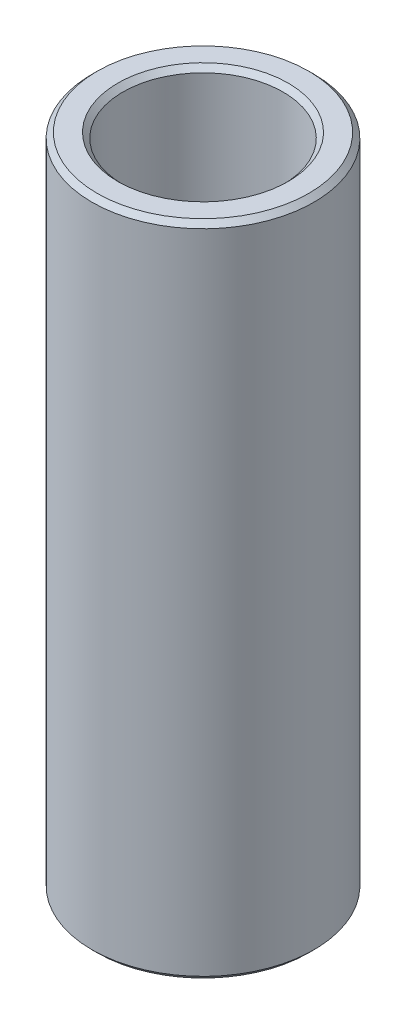
ISO-10303-21;
HEADER;
FILE_DESCRIPTION(('STEP AP214'),'2;1');
FILE_NAME('part.step','',(''),(''),'','','');
FILE_SCHEMA(('AUTOMOTIVE_DESIGN { 1 0 10303 214 1 1 1 1 }'));
ENDSEC;
DATA;
#1=APPLICATION_CONTEXT('core data for automotive mechanical design processes');
#2=APPLICATION_PROTOCOL_DEFINITION('international standard','automotive_design',2000,#1);
#3=PRODUCT_CONTEXT('',#1,'mechanical');
#4=PRODUCT('Part','Part','',(#3));
#5=PRODUCT_RELATED_PRODUCT_CATEGORY('part','',(#4));
#6=PRODUCT_DEFINITION_FORMATION('','',#4);
#7=PRODUCT_DEFINITION_CONTEXT('part definition',#1,'design');
#8=PRODUCT_DEFINITION('design','',#6,#7);
#9=PRODUCT_DEFINITION_SHAPE('','',#8);
#10=(LENGTH_UNIT() NAMED_UNIT(*) SI_UNIT(.MILLI.,.METRE.));
#11=(NAMED_UNIT(*) PLANE_ANGLE_UNIT() SI_UNIT($,.RADIAN.));
#12=(NAMED_UNIT(*) SI_UNIT($,.STERADIAN.) SOLID_ANGLE_UNIT());
#13=UNCERTAINTY_MEASURE_WITH_UNIT(LENGTH_MEASURE(1.E-05),#10,'distance_accuracy_value','');
#14=(GEOMETRIC_REPRESENTATION_CONTEXT(3) GLOBAL_UNCERTAINTY_ASSIGNED_CONTEXT((#13)) GLOBAL_UNIT_ASSIGNED_CONTEXT((#10,
#11,#12)) REPRESENTATION_CONTEXT('',''));
#15=CARTESIAN_POINT('',(0.,0.,0.));
#16=DIRECTION('',(0.,0.,1.));
#17=DIRECTION('',(1.,0.,0.));
#18=AXIS2_PLACEMENT_3D('',#15,#16,#17);
#19=CARTESIAN_POINT('',(0.,74.0944989928561,0.));
#20=DIRECTION('',(0.,-1.,0.));
#21=DIRECTION('',(0.,0.,-1.));
#22=AXIS2_PLACEMENT_3D('',#19,#20,#21);
#23=CYLINDRICAL_SURFACE('',#22,12.5);
#24=CARTESIAN_POINT('',(0.,0.57726071414714,0.));
#25=DIRECTION('',(0.,1.,0.));
#26=DIRECTION('',(0.,0.,1.));
#27=AXIS2_PLACEMENT_3D('',#24,#25,#26);
#28=CIRCLE('',#27,12.5);
#29=CARTESIAN_POINT('',(0.,0.57726071414714,12.5));
#30=VERTEX_POINT('',#29);
#31=EDGE_CURVE('E10',#30,#30,#28,.T.);
#32=ORIENTED_EDGE('',*,*,#31,.T.);
#33=EDGE_LOOP('',(#32));
#34=FACE_BOUND('',#33,.T.);
#35=CARTESIAN_POINT('',(0.,73.517238278709,0.));
#36=DIRECTION('',(0.,1.,0.));
#37=DIRECTION('',(0.,0.,1.));
#38=AXIS2_PLACEMENT_3D('',#35,#36,#37);
#39=CIRCLE('',#38,12.5);
#40=CARTESIAN_POINT('',(0.,73.517238278709,12.5));
#41=VERTEX_POINT('',#40);
#42=EDGE_CURVE('E50',#41,#41,#39,.F.);
#43=ORIENTED_EDGE('',*,*,#42,.T.);
#44=EDGE_LOOP('',(#43));
#45=FACE_BOUND('',#44,.T.);
#46=ADVANCED_FACE('F39',(#34,#45),#23,.T.);
#47=CARTESIAN_POINT('',(0.,74.0944989928561,0.));
#48=DIRECTION('',(0.,1.,0.));
#49=DIRECTION('',(0.,0.,1.));
#50=AXIS2_PLACEMENT_3D('',#47,#48,#49);
#51=PLANE('',#50);
#52=CARTESIAN_POINT('',(0.,74.0944989928561,0.));
#53=DIRECTION('',(0.,1.,0.));
#54=DIRECTION('',(0.,0.,1.));
#55=AXIS2_PLACEMENT_3D('',#52,#53,#54);
#56=CIRCLE('',#55,9.6033951090093);
#57=CARTESIAN_POINT('',(0.,74.0944989928561,9.6033951090093));
#58=VERTEX_POINT('',#57);
#59=EDGE_CURVE('E58',#58,#58,#56,.F.);
#60=ORIENTED_EDGE('',*,*,#59,.T.);
#61=EDGE_LOOP('',(#60));
#62=FACE_BOUND('',#61,.T.);
#63=CARTESIAN_POINT('',(0.,74.0944989928561,0.));
#64=DIRECTION('',(0.,1.,0.));
#65=DIRECTION('',(0.,0.,1.));
#66=AXIS2_PLACEMENT_3D('',#63,#64,#65);
#67=CIRCLE('',#66,11.9227392858529);
#68=CARTESIAN_POINT('',(0.,74.0944989928561,11.9227392858529));
#69=VERTEX_POINT('',#68);
#70=EDGE_CURVE('E61',#69,#69,#67,.T.);
#71=ORIENTED_EDGE('',*,*,#70,.T.);
#72=EDGE_LOOP('',(#71));
#73=FACE_BOUND('',#72,.T.);
#74=ADVANCED_FACE('F88',(#62,#73),#51,.T.);
#75=CARTESIAN_POINT('',(0.,0.,0.));
#76=DIRECTION('',(0.,1.,0.));
#77=DIRECTION('',(0.,0.,1.));
#78=AXIS2_PLACEMENT_3D('',#75,#76,#77);
#79=PLANE('',#78);
#80=CARTESIAN_POINT('',(0.,0.,0.));
#81=DIRECTION('',(0.,1.,0.));
#82=DIRECTION('',(0.,0.,1.));
#83=AXIS2_PLACEMENT_3D('',#80,#81,#82);
#84=CIRCLE('',#83,9.60339510900935);
#85=CARTESIAN_POINT('',(0.,0.,9.60339510900935));
#86=VERTEX_POINT('',#85);
#87=EDGE_CURVE('E51',#86,#86,#84,.T.);
#88=ORIENTED_EDGE('',*,*,#87,.T.);
#89=EDGE_LOOP('',(#88));
#90=FACE_BOUND('',#89,.T.);
#91=CARTESIAN_POINT('',(0.,0.,0.));
#92=DIRECTION('',(0.,1.,0.));
#93=DIRECTION('',(0.,0.,1.));
#94=AXIS2_PLACEMENT_3D('',#91,#92,#93);
#95=CIRCLE('',#94,11.9227392858529);
#96=CARTESIAN_POINT('',(0.,0.,11.9227392858529));
#97=VERTEX_POINT('',#96);
#98=EDGE_CURVE('E54',#97,#97,#95,.F.);
#99=ORIENTED_EDGE('',*,*,#98,.T.);
#100=EDGE_LOOP('',(#99));
#101=FACE_BOUND('',#100,.T.);
#102=ADVANCED_FACE('F83',(#90,#101),#79,.F.);
#103=CARTESIAN_POINT('',(0.,74.0944989928561,0.));
#104=DIRECTION('',(0.,-1.,0.));
#105=DIRECTION('',(0.,0.,-1.));
#106=AXIS2_PLACEMENT_3D('',#103,#104,#105);
#107=CYLINDRICAL_SURFACE('',#106,9.02613439486222);
#108=CARTESIAN_POINT('',(0.,73.517238278709,0.));
#109=DIRECTION('',(0.,1.,0.));
#110=DIRECTION('',(0.,0.,1.));
#111=AXIS2_PLACEMENT_3D('',#108,#109,#110);
#112=CIRCLE('',#111,9.02613439486222);
#113=CARTESIAN_POINT('',(0.,73.517238278709,9.02613439486222));
#114=VERTEX_POINT('',#113);
#115=EDGE_CURVE('E67',#114,#114,#112,.T.);
#116=ORIENTED_EDGE('',*,*,#115,.T.);
#117=EDGE_LOOP('',(#116));
#118=FACE_BOUND('',#117,.T.);
#119=CARTESIAN_POINT('',(0.,0.57726071414714,0.));
#120=DIRECTION('',(0.,1.,0.));
#121=DIRECTION('',(0.,0.,1.));
#122=AXIS2_PLACEMENT_3D('',#119,#120,#121);
#123=CIRCLE('',#122,9.02613439486222);
#124=CARTESIAN_POINT('',(0.,0.57726071414714,9.02613439486222));
#125=VERTEX_POINT('',#124);
#126=EDGE_CURVE('E69',#125,#125,#123,.F.);
#127=ORIENTED_EDGE('',*,*,#126,.T.);
#128=EDGE_LOOP('',(#127));
#129=FACE_BOUND('',#128,.T.);
#130=ADVANCED_FACE('F71',(#118,#129),#107,.F.);
#131=CARTESIAN_POINT('',(0.,73.517238278709,0.));
#132=DIRECTION('',(0.,1.,0.));
#133=DIRECTION('',(0.,0.,1.));
#134=AXIS2_PLACEMENT_3D('',#131,#132,#133);
#135=CONICAL_SURFACE('',#134,9.02613439486222,0.785398163397447);
#136=ORIENTED_EDGE('',*,*,#59,.F.);
#137=EDGE_LOOP('',(#136));
#138=FACE_BOUND('',#137,.T.);
#139=ORIENTED_EDGE('',*,*,#115,.F.);
#140=EDGE_LOOP('',(#139));
#141=FACE_BOUND('',#140,.T.);
#142=ADVANCED_FACE('F77',(#138,#141),#135,.F.);
#143=CARTESIAN_POINT('',(0.,0.,0.));
#144=DIRECTION('',(0.,-1.,0.));
#145=DIRECTION('',(0.,0.,-1.));
#146=AXIS2_PLACEMENT_3D('',#143,#144,#145);
#147=CONICAL_SURFACE('',#146,9.60339510900935,0.785398163397441);
#148=ORIENTED_EDGE('',*,*,#126,.F.);
#149=EDGE_LOOP('',(#148));
#150=FACE_BOUND('',#149,.T.);
#151=ORIENTED_EDGE('',*,*,#87,.F.);
#152=EDGE_LOOP('',(#151));
#153=FACE_BOUND('',#152,.T.);
#154=ADVANCED_FACE('F73',(#150,#153),#147,.F.);
#155=CARTESIAN_POINT('',(0.,0.57726071414714,0.));
#156=DIRECTION('',(0.,1.,0.));
#157=DIRECTION('',(0.,0.,1.));
#158=AXIS2_PLACEMENT_3D('',#155,#156,#157);
#159=CONICAL_SURFACE('',#158,12.5,0.78539816339745);
#160=ORIENTED_EDGE('',*,*,#98,.F.);
#161=EDGE_LOOP('',(#160));
#162=FACE_BOUND('',#161,.T.);
#163=ORIENTED_EDGE('',*,*,#31,.F.);
#164=EDGE_LOOP('',(#163));
#165=FACE_BOUND('',#164,.T.);
#166=ADVANCED_FACE('F76',(#162,#165),#159,.T.);
#167=CARTESIAN_POINT('',(0.,74.0944989928561,0.));
#168=DIRECTION('',(0.,-1.,0.));
#169=DIRECTION('',(0.,0.,-1.));
#170=AXIS2_PLACEMENT_3D('',#167,#168,#169);
#171=CONICAL_SURFACE('',#170,11.9227392858529,0.785398163397439);
#172=ORIENTED_EDGE('',*,*,#42,.F.);
#173=EDGE_LOOP('',(#172));
#174=FACE_BOUND('',#173,.T.);
#175=ORIENTED_EDGE('',*,*,#70,.F.);
#176=EDGE_LOOP('',(#175));
#177=FACE_BOUND('',#176,.T.);
#178=ADVANCED_FACE('F45',(#174,#177),#171,.T.);
#179=CLOSED_SHELL('',(#46,#74,#102,#130,#142,#154,#166,#178));
#180=MANIFOLD_SOLID_BREP('B2',#179);
#181=ADVANCED_BREP_SHAPE_REPRESENTATION('',(#18,#180),#14);
#182=SHAPE_DEFINITION_REPRESENTATION(#9,#181);
ENDSEC;
END-ISO-10303-21;
